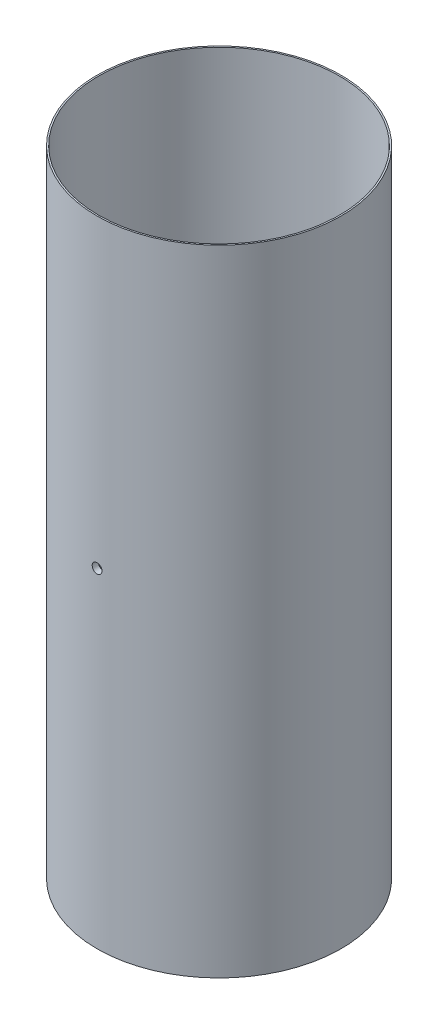
ISO-10303-21;
HEADER;
FILE_DESCRIPTION(('STEP AP214'),'2;1');
FILE_NAME('part.step','',(''),(''),'','','');
FILE_SCHEMA(('AUTOMOTIVE_DESIGN { 1 0 10303 214 1 1 1 1 }'));
ENDSEC;
DATA;
#1=APPLICATION_CONTEXT('core data for automotive mechanical design processes');
#2=APPLICATION_PROTOCOL_DEFINITION('international standard','automotive_design',2000,#1);
#3=PRODUCT_CONTEXT('',#1,'mechanical');
#4=PRODUCT('Part','Part','',(#3));
#5=PRODUCT_RELATED_PRODUCT_CATEGORY('part','',(#4));
#6=PRODUCT_DEFINITION_FORMATION('','',#4);
#7=PRODUCT_DEFINITION_CONTEXT('part definition',#1,'design');
#8=PRODUCT_DEFINITION('design','',#6,#7);
#9=PRODUCT_DEFINITION_SHAPE('','',#8);
#10=(LENGTH_UNIT() NAMED_UNIT(*) SI_UNIT(.MILLI.,.METRE.));
#11=(NAMED_UNIT(*) PLANE_ANGLE_UNIT() SI_UNIT($,.RADIAN.));
#12=(NAMED_UNIT(*) SI_UNIT($,.STERADIAN.) SOLID_ANGLE_UNIT());
#13=UNCERTAINTY_MEASURE_WITH_UNIT(LENGTH_MEASURE(1.E-05),#10,'distance_accuracy_value','');
#14=(GEOMETRIC_REPRESENTATION_CONTEXT(3) GLOBAL_UNCERTAINTY_ASSIGNED_CONTEXT((#13)) GLOBAL_UNIT_ASSIGNED_CONTEXT((#10,
#11,#12)) REPRESENTATION_CONTEXT('',''));
#15=CARTESIAN_POINT('',(0.,0.,0.));
#16=DIRECTION('',(0.,0.,1.));
#17=DIRECTION('',(1.,0.,0.));
#18=AXIS2_PLACEMENT_3D('',#15,#16,#17);
#19=CARTESIAN_POINT('',(0.,330.2,0.));
#20=DIRECTION('',(0.,-1.,0.));
#21=DIRECTION('',(0.,0.,-1.));
#22=AXIS2_PLACEMENT_3D('',#19,#20,#21);
#23=CYLINDRICAL_SURFACE('',#22,60.325);
#24=CARTESIAN_POINT('',(0.,174.0027,-60.325));
#25=CARTESIAN_POINT('',(-0.143317457979094,174.002693665914,-60.3249992751451));
#26=CARTESIAN_POINT('',(-0.286737200478642,173.990589962888,-60.324483795179));
#27=CARTESIAN_POINT('',(-0.569622111762452,173.942476494996,-60.3224769989852));
#28=CARTESIAN_POINT('',(-0.709082387997426,173.906438390723,-60.320984525984));
#29=CARTESIAN_POINT('',(-0.979909444397827,173.81148810979,-60.3171927090526));
#30=CARTESIAN_POINT('',(-1.11128023793964,173.752587383477,-60.3148937690829));
#31=CARTESIAN_POINT('',(-1.36223370345956,173.613600917658,-60.3097481113025));
#32=CARTESIAN_POINT('',(-1.48181919077537,173.53352025465,-60.3069015247986));
#33=CARTESIAN_POINT('',(-1.705935017377,173.354377973229,-60.3009784961359));
#34=CARTESIAN_POINT('',(-1.81045532214481,173.255303805161,-60.2979019028284));
#35=CARTESIAN_POINT('',(-2.00138861875198,173.041011099307,-60.2918669243713));
#36=CARTESIAN_POINT('',(-2.08780087922406,172.925791909751,-60.2889085440003));
#37=CARTESIAN_POINT('',(-2.24008967662076,172.68243121604,-60.2834426122802));
#38=CARTESIAN_POINT('',(-2.30595885682802,172.554285104293,-60.2809352225719));
#39=CARTESIAN_POINT('',(-2.41524436635302,172.288740702387,-60.2766557460153));
#40=CARTESIAN_POINT('',(-2.45866083037463,172.151342467741,-60.2748836547557));
#41=CARTESIAN_POINT('',(-2.52178326275869,171.871282047725,-60.2722758995969));
#42=CARTESIAN_POINT('',(-2.54150354843724,171.728623094666,-60.2714396702675));
#43=CARTESIAN_POINT('',(-2.55671799242051,171.442017405511,-60.2707962354679));
#44=CARTESIAN_POINT('',(-2.5522122999977,171.298070677357,-60.2709890236571));
#45=CARTESIAN_POINT('',(-2.51911465926179,171.013072769191,-60.2723813576297));
#46=CARTESIAN_POINT('',(-2.4905381747698,170.872019789726,-60.2735802570543));
#47=CARTESIAN_POINT('',(-2.41013408086554,170.596714825083,-60.2768486574536));
#48=CARTESIAN_POINT('',(-2.35830639402456,170.462462862555,-60.2789181613274));
#49=CARTESIAN_POINT('',(-2.23285338707313,170.204521009726,-60.2836952470259));
#50=CARTESIAN_POINT('',(-2.15922099951244,170.080834560747,-60.2864030356764));
#51=CARTESIAN_POINT('',(-1.99225392122157,169.847572408147,-60.2921512598635));
#52=CARTESIAN_POINT('',(-1.89891913310817,169.737996774276,-60.2951916970442));
#53=CARTESIAN_POINT('',(-1.69510933225527,169.535976672786,-60.3012653792618));
#54=CARTESIAN_POINT('',(-1.58462092257578,169.443545720025,-60.3042986167797));
#55=CARTESIAN_POINT('',(-1.34968739191737,169.278542854933,-60.3100136961694));
#56=CARTESIAN_POINT('',(-1.22524226808617,169.205970946661,-60.3126955379693));
#57=CARTESIAN_POINT('',(-0.965920108532502,169.082747604621,-60.3174056285244));
#58=CARTESIAN_POINT('',(-0.831042858191566,169.032096621969,-60.3194338638285));
#59=CARTESIAN_POINT('',(-0.55468856139866,168.954161668013,-60.3226079310419));
#60=CARTESIAN_POINT('',(-0.413211550413143,168.926877571153,-60.3237537676924));
#61=CARTESIAN_POINT('',(-0.127791119203112,168.896467498313,-60.3250332802157));
#62=CARTESIAN_POINT('',(0.0161503055997033,168.893322825337,-60.3251677394411));
#63=CARTESIAN_POINT('',(0.302516740314691,168.91123210344,-60.3244114198497));
#64=CARTESIAN_POINT('',(0.444941753794973,168.932285997568,-60.3235206434458));
#65=CARTESIAN_POINT('',(0.724180174019501,168.997979293169,-60.3208147142999));
#66=CARTESIAN_POINT('',(0.860995587746223,169.042610178587,-60.3189998953324));
#67=CARTESIAN_POINT('',(1.1251928643938,169.154181916951,-60.3146502833695));
#68=CARTESIAN_POINT('',(1.25257468860698,169.221122861433,-60.31211548742));
#69=CARTESIAN_POINT('',(1.4943748341866,169.375462507485,-60.3066092958923));
#70=CARTESIAN_POINT('',(1.60878513497744,169.462873765013,-60.3036376327692));
#71=CARTESIAN_POINT('',(1.82131394325068,169.655654368962,-60.2975933739145));
#72=CARTESIAN_POINT('',(1.91943237418402,169.761023799758,-60.2945207777086));
#73=CARTESIAN_POINT('',(2.09665495349342,169.986810001499,-60.2886187676289));
#74=CARTESIAN_POINT('',(2.17574702044189,170.107236259923,-60.2857895089989));
#75=CARTESIAN_POINT('',(2.31258917849996,170.359669552573,-60.2806956275811));
#76=CARTESIAN_POINT('',(2.37033934272182,170.491676547125,-60.2784310028588));
#77=CARTESIAN_POINT('',(2.46283725385677,170.76347903814,-60.274722850436));
#78=CARTESIAN_POINT('',(2.49759275293561,170.903271892516,-60.2732790460364));
#79=CARTESIAN_POINT('',(2.54314012865479,171.186715035704,-60.2713745560592));
#80=CARTESIAN_POINT('',(2.55393209026697,171.330365310836,-60.2709138669957));
#81=CARTESIAN_POINT('',(2.55124516330251,171.617325170998,-60.271027652173));
#82=CARTESIAN_POINT('',(2.53778529304992,171.760634934818,-60.2716013152736));
#83=CARTESIAN_POINT('',(2.48701602108585,172.042958399298,-60.2737174315815));
#84=CARTESIAN_POINT('',(2.44970657301593,172.181972091606,-60.275259886672));
#85=CARTESIAN_POINT('',(2.35230077757007,172.451762191647,-60.2791395577469));
#86=CARTESIAN_POINT('',(2.29220414697198,172.582538496973,-60.2814767836096));
#87=CARTESIAN_POINT('',(2.15093392569781,172.832145027295,-60.2866824629476));
#88=CARTESIAN_POINT('',(2.06976103281406,172.950975647609,-60.2895508988348));
#89=CARTESIAN_POINT('',(1.88857702492375,173.173410959401,-60.2954981735654));
#90=CARTESIAN_POINT('',(1.78855320635184,173.277005298901,-60.2985771533968));
#91=CARTESIAN_POINT('',(1.57250461106337,173.465962240335,-60.3045977232874));
#92=CARTESIAN_POINT('',(1.45647589280637,173.551320337974,-60.3075392792636));
#93=CARTESIAN_POINT('',(1.21164043765563,173.701410349287,-60.3129550624573));
#94=CARTESIAN_POINT('',(1.08282330374682,173.766125296948,-60.3154289045977));
#95=CARTESIAN_POINT('',(0.816239502913559,173.872932594486,-60.3196242956862));
#96=CARTESIAN_POINT('',(0.678483670473789,173.915051778764,-60.3213467365311));
#97=CARTESIAN_POINT('',(0.449887952200836,173.964373344458,-60.3233875427674));
#98=CARTESIAN_POINT('',(0.360530143175026,173.978727608783,-60.3239895718358));
#99=CARTESIAN_POINT('',(0.180795126305207,173.997892931756,-60.3247960289856));
#100=CARTESIAN_POINT('',(0.0904179190728285,174.002703996128,-60.3250004573056));
#101=CARTESIAN_POINT('',(0.,174.0027,-60.325));
#102=B_SPLINE_CURVE_WITH_KNOTS('',3,(#24,#25,#26,#27,#28,#29,#30,#31,#32,#33,#34,#35,#36,#37,
#38,#39,#40,#41,#42,#43,#44,#45,#46,#47,#48,#49,#50,#51,#52,#53,#54,#55,#56,#57,#58,#59,#60,#61,
#62,#63,#64,#65,#66,#67,#68,#69,#70,#71,#72,#73,#74,#75,#76,#77,#78,#79,#80,#81,#82,#83,#84,#85,
#86,#87,#88,#89,#90,#91,#92,#93,#94,#95,#96,#97,#98,#99,#100,#101),.UNSPECIFIED.,.T.,.F.,(4,2,2,
2,2,2,2,2,2,2,2,2,2,2,2,2,2,2,2,2,2,2,2,2,2,2,2,2,2,2,2,2,2,2,2,2,2,2,4),(0.,0.42962232463234,
0.859754250487278,1.28967102961894,1.71948485768683,2.14958366330685,2.57969983687575,
3.00996986368173,3.44023730907534,3.87024465440208,4.30024935016874,4.72997800812708,
5.15970809713291,5.58957762517492,6.01944927798641,6.44965836433409,6.87986753860206,
7.31008556584942,7.74030128141452,8.17018374320933,8.60006519326841,9.02979147536634,
9.45951952060887,9.88951184343607,10.3195061865701,10.7497728525404,11.1800380445064,
11.6101581076354,12.0402766456074,12.4700580307486,12.8998402512945,13.3296278137838,
13.759401148692,14.1894651485486,14.6196352503595,15.0501579910972,15.4801683110534,
15.7512140052349,16.0222595367999),.UNSPECIFIED.);
#103=CARTESIAN_POINT('',(0.,174.0027,-60.325));
#104=VERTEX_POINT('',#103);
#105=EDGE_CURVE('E135',#104,#104,#102,.T.);
#106=ORIENTED_EDGE('',*,*,#105,.F.);
#107=EDGE_LOOP('',(#106));
#108=FACE_BOUND('',#107,.T.);
#109=CARTESIAN_POINT('',(2.55269999999999,171.45,60.2709660426146));
#110=CARTESIAN_POINT('',(2.55269366585535,171.306682606805,60.270966769915));
#111=CARTESIAN_POINT('',(2.54058997340111,171.163262928867,60.2714827238882));
#112=CARTESIAN_POINT('',(2.49247655132331,170.880378151732,60.27349121323));
#113=CARTESIAN_POINT('',(2.4564384820735,170.740917945135,60.2749849062656));
#114=CARTESIAN_POINT('',(2.36148830361135,170.470091035932,60.2787793713388));
#115=CARTESIAN_POINT('',(2.30258764641778,170.338720319361,60.2810797392522));
#116=CARTESIAN_POINT('',(2.16360134332727,170.087766982597,60.2862278359019));
#117=CARTESIAN_POINT('',(2.08352077375679,169.968181547165,60.2890754334355));
#118=CARTESIAN_POINT('',(1.9043785863625,169.744065661118,60.2949996290089));
#119=CARTESIAN_POINT('',(1.8053043980447,169.63954526166,60.2980763778779));
#120=CARTESIAN_POINT('',(1.59101161204826,169.448611782545,60.3041107398421));
#121=CARTESIAN_POINT('',(1.47579236285749,169.362199433965,60.3070683481233));
#122=CARTESIAN_POINT('',(1.23243161774974,169.209910545102,60.3125321439056));
#123=CARTESIAN_POINT('',(1.10428552448965,169.144041345169,60.3150381699156));
#124=CARTESIAN_POINT('',(0.838741162783114,169.034755794061,60.3193149277687));
#125=CARTESIAN_POINT('',(0.701342949751084,168.991339308423,60.3210856640152));
#126=CARTESIAN_POINT('',(0.421282592446688,168.928216829876,60.3236913133244));
#127=CARTESIAN_POINT('',(0.278623680828125,168.908496518101,60.3245267915137));
#128=CARTESIAN_POINT('',(-0.00798192744215867,168.893282007569,60.3251696566807));
#129=CARTESIAN_POINT('',(-0.151928616168194,168.897787659815,60.3249770499815));
#130=CARTESIAN_POINT('',(-0.436926703465465,168.930885237666,60.3235859311543));
#131=CARTESIAN_POINT('',(-0.577979896774923,168.959461739873,60.3223880631493));
#132=CARTESIAN_POINT('',(-0.853285279983554,169.039865943618,60.3191221230065));
#133=CARTESIAN_POINT('',(-0.987537447348437,169.091693722189,60.3170540479855));
#134=CARTESIAN_POINT('',(-1.2454795456604,169.217146917569,60.3122795948867));
#135=CARTESIAN_POINT('',(-1.36916604582705,169.290779380178,60.3095730105435));
#136=CARTESIAN_POINT('',(-1.60242826883088,169.457746617844,60.3038264409255));
#137=CARTESIAN_POINT('',(-1.71200392188386,169.551081490331,60.3007864540021));
#138=CARTESIAN_POINT('',(-1.91402392536733,169.754891350147,60.294712724434));
#139=CARTESIAN_POINT('',(-2.006454778053,169.865379717418,60.2916789885532));
#140=CARTESIAN_POINT('',(-2.17145746156611,170.100313127896,60.2859621782017));
#141=CARTESIAN_POINT('',(-2.24402928813479,170.224758174094,60.2832791038062));
#142=CARTESIAN_POINT('',(-2.36725257171868,170.484080314517,60.2785663515859));
#143=CARTESIAN_POINT('',(-2.4179035520588,170.618957635519,60.2765366879699));
#144=CARTESIAN_POINT('',(-2.49583847965579,170.895312085615,60.2733601982388));
#145=CARTESIAN_POINT('',(-2.52312255288602,171.036789179125,60.2722133673642));
#146=CARTESIAN_POINT('',(-2.55353253690702,171.322209645685,60.2709327384656));
#147=CARTESIAN_POINT('',(-2.55667716719104,171.466151020912,60.270798155472));
#148=CARTESIAN_POINT('',(-2.53876782140728,171.752517346154,60.2715551499145));
#149=CARTESIAN_POINT('',(-2.51771390228666,171.894942299736,60.2724467249357));
#150=CARTESIAN_POINT('',(-2.4520206165943,172.174180437366,60.2751548224208));
#151=CARTESIAN_POINT('',(-2.40738979121927,172.310995634327,60.2769710099172));
#152=CARTESIAN_POINT('',(-2.29581824572706,172.575192504094,60.2813233301554));
#153=CARTESIAN_POINT('',(-2.22887743372344,172.702574138042,60.2838594658624));
#154=CARTESIAN_POINT('',(-2.07453797998615,172.94437415868,60.2893677272064));
#155=CARTESIAN_POINT('',(-1.98712674858355,173.058784503273,60.2923401207281));
#156=CARTESIAN_POINT('',(-1.79434617221696,173.27131341213,60.2983849063888));
#157=CARTESIAN_POINT('',(-1.68897674308451,173.369431900033,60.3014572989965));
#158=CARTESIAN_POINT('',(-1.46319051552521,173.546654595771,60.3073580568805));
#159=CARTESIAN_POINT('',(-1.34276422951219,173.625746722063,60.3101862663762));
#160=CARTESIAN_POINT('',(-1.09033086648997,173.762588984389,60.3152776633471));
#161=CARTESIAN_POINT('',(-0.958323829156338,173.820339193535,60.3175408527578));
#162=CARTESIAN_POINT('',(-0.686521370575466,173.912837135892,60.3212463770604));
#163=CARTESIAN_POINT('',(-0.546728598031786,173.947592640689,60.322688989262));
#164=CARTESIAN_POINT('',(-0.26328562688929,173.993140055599,60.3245918626342));
#165=CARTESIAN_POINT('',(-0.119635441900555,174.003932050249,60.3250521272704));
#166=CARTESIAN_POINT('',(0.167324480361365,174.001245216798,60.3249384478098));
#167=CARTESIAN_POINT('',(0.310634396047115,173.987785367746,60.3243653124329));
#168=CARTESIAN_POINT('',(0.592958169379343,173.937016084621,60.3222509703151));
#169=CARTESIAN_POINT('',(0.73197201872382,173.899706604463,60.3207097617036));
#170=CARTESIAN_POINT('',(1.00176242336622,173.802300688776,60.316832756721));
#171=CARTESIAN_POINT('',(1.1325388762738,173.742203970069,60.3144969504754));
#172=CARTESIAN_POINT('',(1.38214566478745,173.600933527126,60.3092936617772));
#173=CARTESIAN_POINT('',(1.50097639580075,173.519760500842,60.3064261969316));
#174=CARTESIAN_POINT('',(1.7234116935399,173.338576349411,60.3004799962356));
#175=CARTESIAN_POINT('',(1.8270059329349,173.238552550974,60.2974011191442));
#176=CARTESIAN_POINT('',(2.01596268183733,173.022504036694,60.2913798359727));
#177=CARTESIAN_POINT('',(2.10132068679335,172.906475379094,60.2884374637512));
#178=CARTESIAN_POINT('',(2.25141060196452,172.661639970102,60.2830194834172));
#179=CARTESIAN_POINT('',(2.31612552854995,172.532822810909,60.2805442603213));
#180=CARTESIAN_POINT('',(2.42293277960863,172.266238955828,60.2763461543542));
#181=CARTESIAN_POINT('',(2.4650519388165,172.128483094566,60.2746223795213));
#182=CARTESIAN_POINT('',(2.51437343155852,171.89988744372,60.2725799087108));
#183=CARTESIAN_POINT('',(2.52872766312235,171.810529736095,60.2719773603131));
#184=CARTESIAN_POINT('',(2.54789294255275,171.630794922529,60.2711701979607));
#185=CARTESIAN_POINT('',(2.55270399616207,171.540417817202,60.2709655837665));
#186=CARTESIAN_POINT('',(2.55269999999999,171.45,60.2709660426146));
#187=B_SPLINE_CURVE_WITH_KNOTS('',3,(#109,#110,#111,#112,#113,#114,#115,#116,#117,#118,#119,
#120,#121,#122,#123,#124,#125,#126,#127,#128,#129,#130,#131,#132,#133,#134,#135,#136,#137,#138,
#139,#140,#141,#142,#143,#144,#145,#146,#147,#148,#149,#150,#151,#152,#153,#154,#155,#156,#157,
#158,#159,#160,#161,#162,#163,#164,#165,#166,#167,#168,#169,#170,#171,#172,#173,#174,#175,#176,
#177,#178,#179,#180,#181,#182,#183,#184,#185,#186),.UNSPECIFIED.,.T.,.F.,(4,2,2,2,2,2,2,2,2,2,2,
2,2,2,2,2,2,2,2,2,2,2,2,2,2,2,2,2,2,2,2,2,2,2,2,2,2,2,4),(0.,0.429622130074634,
0.859753865607661,1.28967042282568,1.71948403239451,2.14958309251469,2.57969951370257,
3.00996944577267,3.4402368010235,3.87024402802001,4.30024861033492,4.72997787661082,
5.15970856664404,5.58957826838809,6.01945009594058,6.44965892939677,6.87986785511062,
7.31008613537079,7.74030209626622,8.17018440243942,8.60006569696022,9.02979136524064,
9.45951880342153,9.88951122887147,10.3195056697128,10.7497724360557,11.1800377283655,
11.6101575282617,12.0402758107685,12.4700576367726,12.8998402932635,13.329628290873,
13.7594020576743,14.1894657968488,14.6196356440103,15.0501584963708,15.4801689215163,
15.7512143105836,16.0222595365451),.UNSPECIFIED.);
#188=CARTESIAN_POINT('',(2.55269999999999,171.45,60.2709660426146));
#189=VERTEX_POINT('',#188);
#190=EDGE_CURVE('E74',#189,#189,#187,.T.);
#191=ORIENTED_EDGE('',*,*,#190,.F.);
#192=EDGE_LOOP('',(#191));
#193=FACE_BOUND('',#192,.T.);
#194=CARTESIAN_POINT('',(0.,158.75,0.));
#195=DIRECTION('',(0.,1.,0.));
#196=DIRECTION('',(0.,0.,1.));
#197=AXIS2_PLACEMENT_3D('',#194,#195,#196);
#198=CIRCLE('',#197,60.325);
#199=CARTESIAN_POINT('',(0.,158.75,60.325));
#200=VERTEX_POINT('',#199);
#201=EDGE_CURVE('E53',#200,#200,#198,.T.);
#202=ORIENTED_EDGE('',*,*,#201,.F.);
#203=EDGE_LOOP('',(#202));
#204=FACE_BOUND('',#203,.T.);
#205=CARTESIAN_POINT('',(0.,209.55,0.));
#206=DIRECTION('',(0.,1.,0.));
#207=DIRECTION('',(0.,0.,1.));
#208=AXIS2_PLACEMENT_3D('',#205,#206,#207);
#209=CIRCLE('',#208,60.325);
#210=CARTESIAN_POINT('',(0.,209.55,60.325));
#211=VERTEX_POINT('',#210);
#212=EDGE_CURVE('E62',#211,#211,#209,.T.);
#213=ORIENTED_EDGE('',*,*,#212,.T.);
#214=EDGE_LOOP('',(#213));
#215=FACE_BOUND('',#214,.T.);
#216=ADVANCED_FACE('F36',(#108,#193,#204,#215),#23,.F.);
#217=CARTESIAN_POINT('',(0.,0.,0.));
#218=DIRECTION('',(0.,1.,0.));
#219=DIRECTION('',(0.,0.,1.));
#220=AXIS2_PLACEMENT_3D('',#217,#218,#219);
#221=PLANE('',#220);
#222=CARTESIAN_POINT('',(0.,0.,0.));
#223=DIRECTION('',(0.,1.,0.));
#224=DIRECTION('',(0.,0.,1.));
#225=AXIS2_PLACEMENT_3D('',#222,#223,#224);
#226=CIRCLE('',#225,63.5);
#227=CARTESIAN_POINT('',(0.,0.,63.5));
#228=VERTEX_POINT('',#227);
#229=EDGE_CURVE('E41',#228,#228,#226,.T.);
#230=ORIENTED_EDGE('',*,*,#229,.F.);
#231=EDGE_LOOP('',(#230));
#232=FACE_BOUND('',#231,.T.);
#233=CARTESIAN_POINT('',(0.,0.,0.));
#234=DIRECTION('',(0.,1.,0.));
#235=DIRECTION('',(0.,0.,1.));
#236=AXIS2_PLACEMENT_3D('',#233,#234,#235);
#237=CIRCLE('',#236,62.70625);
#238=CARTESIAN_POINT('',(0.,0.,62.70625));
#239=VERTEX_POINT('',#238);
#240=EDGE_CURVE('E50',#239,#239,#237,.T.);
#241=ORIENTED_EDGE('',*,*,#240,.T.);
#242=EDGE_LOOP('',(#241));
#243=FACE_BOUND('',#242,.T.);
#244=ADVANCED_FACE('F109',(#232,#243),#221,.F.);
#245=CARTESIAN_POINT('',(0.,330.2,0.));
#246=DIRECTION('',(0.,1.,0.));
#247=DIRECTION('',(0.,0.,1.));
#248=AXIS2_PLACEMENT_3D('',#245,#246,#247);
#249=PLANE('',#248);
#250=CARTESIAN_POINT('',(0.,330.2,0.));
#251=DIRECTION('',(0.,1.,0.));
#252=DIRECTION('',(0.,0.,1.));
#253=AXIS2_PLACEMENT_3D('',#250,#251,#252);
#254=CIRCLE('',#253,62.70625);
#255=CARTESIAN_POINT('',(0.,330.2,62.70625));
#256=VERTEX_POINT('',#255);
#257=EDGE_CURVE('E59',#256,#256,#254,.T.);
#258=ORIENTED_EDGE('',*,*,#257,.F.);
#259=EDGE_LOOP('',(#258));
#260=FACE_BOUND('',#259,.T.);
#261=CARTESIAN_POINT('',(0.,330.2,0.));
#262=DIRECTION('',(0.,1.,0.));
#263=DIRECTION('',(0.,0.,1.));
#264=AXIS2_PLACEMENT_3D('',#261,#262,#263);
#265=CIRCLE('',#264,63.5);
#266=CARTESIAN_POINT('',(0.,330.2,63.5));
#267=VERTEX_POINT('',#266);
#268=EDGE_CURVE('E10',#267,#267,#265,.T.);
#269=ORIENTED_EDGE('',*,*,#268,.T.);
#270=EDGE_LOOP('',(#269));
#271=FACE_BOUND('',#270,.T.);
#272=ADVANCED_FACE('F111',(#260,#271),#249,.T.);
#273=CARTESIAN_POINT('',(0.,330.2,0.));
#274=DIRECTION('',(0.,-1.,0.));
#275=DIRECTION('',(0.,0.,-1.));
#276=AXIS2_PLACEMENT_3D('',#273,#274,#275);
#277=CYLINDRICAL_SURFACE('',#276,63.5);
#278=CARTESIAN_POINT('',(0.,174.0027,-63.5));
#279=CARTESIAN_POINT('',(-0.143324163865528,174.002693663444,-63.4999993108626));
#280=CARTESIAN_POINT('',(-0.286750776503003,173.990588832225,-63.4995095585936));
#281=CARTESIAN_POINT('',(-0.569649698596532,173.942470621785,-63.4976029218357));
#282=CARTESIAN_POINT('',(-0.709117108177663,173.906428857747,-63.4961849366614));
#283=CARTESIAN_POINT('',(-0.979958466547345,173.811468284893,-63.4925823764552));
#284=CARTESIAN_POINT('',(-1.11133641098022,173.752560876888,-63.4903981835068));
#285=CARTESIAN_POINT('',(-1.36230276367632,173.613558063883,-63.4855094101114));
#286=CARTESIAN_POINT('',(-1.48189399790386,173.533467754709,-63.4828049548631));
#287=CARTESIAN_POINT('',(-1.70601264493531,173.354308618505,-63.4771779187533));
#288=CARTESIAN_POINT('',(-1.81053084461074,173.255228269583,-63.4742552061283));
#289=CARTESIAN_POINT('',(-2.00145838710848,173.040923561139,-63.4685222100152));
#290=CARTESIAN_POINT('',(-2.08786700052276,172.925698551662,-63.4657119310593));
#291=CARTESIAN_POINT('',(-2.24014403601524,172.682332029694,-63.4605198749886));
#292=CARTESIAN_POINT('',(-2.30600585832989,172.554186384463,-63.4581382356594));
#293=CARTESIAN_POINT('',(-2.41527721344684,172.288645393164,-63.45407349426));
#294=CARTESIAN_POINT('',(-2.45868687218565,172.151250098983,-63.4523903882716));
#295=CARTESIAN_POINT('',(-2.52179893348719,171.871189345103,-63.4499136141698));
#296=CARTESIAN_POINT('',(-2.54151425445321,171.728526800939,-63.4491194614059));
#297=CARTESIAN_POINT('',(-2.55671782931915,171.441915022742,-63.4485086868518));
#298=CARTESIAN_POINT('',(-2.55220622218856,171.297965796096,-63.4486920594545));
#299=CARTESIAN_POINT('',(-2.5190948250792,171.012954536371,-63.4500152062028));
#300=CARTESIAN_POINT('',(-2.49050898803539,170.871890879372,-63.4511544263571));
#301=CARTESIAN_POINT('',(-2.41008218368811,170.596566132232,-63.4542599821565));
#302=CARTESIAN_POINT('',(-2.35824114407913,170.462305063243,-63.4562263203732));
#303=CARTESIAN_POINT('',(-2.23275952639916,170.204351701722,-63.4607651064348));
#304=CARTESIAN_POINT('',(-2.15911256763877,170.080662516328,-63.4633377316418));
#305=CARTESIAN_POINT('',(-1.99211436136792,169.847398025356,-63.4687989202082));
#306=CARTESIAN_POINT('',(-1.89876302672559,169.737822782192,-63.4716874849645));
#307=CARTESIAN_POINT('',(-1.69492713162012,169.535815374865,-63.4774574157225));
#308=CARTESIAN_POINT('',(-1.58443048156107,169.443395409099,-63.4803387751754));
#309=CARTESIAN_POINT('',(-1.34948311913359,169.278415970977,-63.4857675327437));
#310=CARTESIAN_POINT('',(-1.22503240404121,169.205856502498,-63.4883149307938));
#311=CARTESIAN_POINT('',(-0.965702663795686,169.082659026906,-63.4927887022344));
#312=CARTESIAN_POINT('',(-0.83082344717747,169.032021422386,-63.4947150642194));
#313=CARTESIAN_POINT('',(-0.554468529310304,168.954112960823,-63.4977294596276));
#314=CARTESIAN_POINT('',(-0.412992860080086,168.926841990372,-63.4988174971195));
#315=CARTESIAN_POINT('',(-0.127566965425893,168.896455906389,-63.5000320846466));
#316=CARTESIAN_POINT('',(0.0163814606246293,168.893323916424,-63.5001593064215));
#317=CARTESIAN_POINT('',(0.302759796805921,168.9112606915,-63.4994397041971));
#318=CARTESIAN_POINT('',(0.445189710153911,168.932329405258,-63.4985928822618));
#319=CARTESIAN_POINT('',(0.724440803678022,168.998055557016,-63.4960210368165));
#320=CARTESIAN_POINT('',(0.861263794821022,169.042705312879,-63.4942962993169));
#321=CARTESIAN_POINT('',(1.12547283299773,169.154318317662,-63.4901628977695));
#322=CARTESIAN_POINT('',(1.25285884516994,169.221281649006,-63.4877542311955));
#323=CARTESIAN_POINT('',(1.49465550486585,169.375664311978,-63.4825224674313));
#324=CARTESIAN_POINT('',(1.60905890805599,169.463094981914,-63.4796991408558));
#325=CARTESIAN_POINT('',(1.82157006426561,169.655913876299,-63.4739569107453));
#326=CARTESIAN_POINT('',(1.91967774758246,169.761302177555,-63.4710380068016));
#327=CARTESIAN_POINT('',(2.09686912086968,169.987117199954,-63.4654317380428));
#328=CARTESIAN_POINT('',(2.1759419091002,170.107552479173,-63.4627445064749));
#329=CARTESIAN_POINT('',(2.3127444063352,170.359999305218,-63.4579066704929));
#330=CARTESIAN_POINT('',(2.37047418356619,170.492010815037,-63.4557560643634));
#331=CARTESIAN_POINT('',(2.4629328476805,170.763822030366,-63.4522349230489));
#332=CARTESIAN_POINT('',(2.49766874109287,170.903619349351,-63.4508641502566));
#333=CARTESIAN_POINT('',(2.54317655354907,171.18706743842,-63.4490565697664));
#334=CARTESIAN_POINT('',(2.55394854502168,171.330718196856,-63.4486197592457));
#335=CARTESIAN_POINT('',(2.55122198426378,171.617686730906,-63.4487294402859));
#336=CARTESIAN_POINT('',(2.53774059726566,171.761004670195,-63.449275236411));
#337=CARTESIAN_POINT('',(2.48692536734883,172.043341007101,-63.4512871420568));
#338=CARTESIAN_POINT('',(2.44959147786673,172.182359396324,-63.4527532533739));
#339=CARTESIAN_POINT('',(2.35213412028957,172.452155071768,-63.4564403902687));
#340=CARTESIAN_POINT('',(2.29201034561928,172.5829322471,-63.4586614260018));
#341=CARTESIAN_POINT('',(2.15068378776467,172.832535502093,-63.4636079709533));
#342=CARTESIAN_POINT('',(2.06948171504609,172.951361984378,-63.4663334631676));
#343=CARTESIAN_POINT('',(1.8882454314426,173.173774447248,-63.4719838244392));
#344=CARTESIAN_POINT('',(1.78819994642528,173.277351237404,-63.4749088121842));
#345=CARTESIAN_POINT('',(1.57211121270376,173.466269200863,-63.4806279276599));
#346=CARTESIAN_POINT('',(1.45606402046022,173.551605865719,-63.4834220229047));
#347=CARTESIAN_POINT('',(1.2112003105724,173.701646961239,-63.488565836553));
#348=CARTESIAN_POINT('',(1.08237382857637,173.766335123308,-63.490915203973));
#349=CARTESIAN_POINT('',(0.81577735670584,173.8730879766,-63.4948990520177));
#350=CARTESIAN_POINT('',(0.678018205643144,173.915179531199,-63.4965343810742));
#351=CARTESIAN_POINT('',(0.449495981723146,173.964440597619,-63.4984708402344));
#352=CARTESIAN_POINT('',(0.360214849140348,173.978769702843,-63.4990417727471));
#353=CARTESIAN_POINT('',(0.180636044570101,173.997901398457,-63.4998065697127));
#354=CARTESIAN_POINT('',(0.0903383731305897,174.002703993982,-63.5000004343688));
#355=CARTESIAN_POINT('',(0.,174.0027,-63.5));
#356=B_SPLINE_CURVE_WITH_KNOTS('',3,(#278,#279,#280,#281,#282,#283,#284,#285,#286,#287,#288,
#289,#290,#291,#292,#293,#294,#295,#296,#297,#298,#299,#300,#301,#302,#303,#304,#305,#306,#307,
#308,#309,#310,#311,#312,#313,#314,#315,#316,#317,#318,#319,#320,#321,#322,#323,#324,#325,#326,
#327,#328,#329,#330,#331,#332,#333,#334,#335,#336,#337,#338,#339,#340,#341,#342,#343,#344,#345,
#346,#347,#348,#349,#350,#351,#352,#353,#354,#355),.UNSPECIFIED.,.T.,.F.,(4,2,2,2,2,2,2,2,2,2,2,
2,2,2,2,2,2,2,2,2,2,2,2,2,2,2,2,2,2,2,2,2,2,2,2,2,2,2,4),(0.,0.429642735051301,
0.859795859509039,1.28973478451083,1.71957037593729,2.1496675933084,2.57978213057264,
3.01003468152736,3.4402848191247,3.87030027323007,4.30031326070125,4.73007719275393,
5.15984246104587,5.58973360861272,6.01962665717901,6.44982422340235,6.88002187360387,
7.3102274240195,7.74043088646398,8.17033355080105,8.60023530413728,9.02999709213105,
9.45976046764507,9.88976248529206,10.3197663421639,10.750015889714,11.1802640618872,
11.6103810715439,12.0404967812079,12.4703081979327,12.9001204537118,13.329938491638,
13.7597420439855,14.1898035721174,14.6199712767833,15.0504770712375,15.4804699305665,
15.7512773477203,16.0220846189096),.UNSPECIFIED.);
#357=CARTESIAN_POINT('',(0.,174.0027,-63.5));
#358=VERTEX_POINT('',#357);
#359=EDGE_CURVE('E130',#358,#358,#356,.T.);
#360=ORIENTED_EDGE('',*,*,#359,.T.);
#361=EDGE_LOOP('',(#360));
#362=FACE_BOUND('',#361,.T.);
#363=CARTESIAN_POINT('',(2.55269999999999,171.45,63.4486699837751));
#364=CARTESIAN_POINT('',(2.552693663396,171.306675888904,63.4486706750145));
#365=CARTESIAN_POINT('',(2.54058884078871,171.163249328855,63.4491608337411));
#366=CARTESIAN_POINT('',(2.49247066766812,170.880350516032,63.4510689222643));
#367=CARTESIAN_POINT('',(2.45642893215974,170.740883163174,63.4524879535126));
#368=CARTESIAN_POINT('',(2.36146844277739,170.470041924702,63.4560927843434));
#369=CARTESIAN_POINT('',(2.30256109107704,170.338664042964,63.4582782017073));
#370=CARTESIAN_POINT('',(2.16355841062886,170.08769779514,63.4631690663193));
#371=CARTESIAN_POINT('',(2.08346817756834,169.96810660317,63.4658743884579));
#372=CARTESIAN_POINT('',(1.90430911795094,169.743987907707,63.471502424737));
#373=CARTESIAN_POINT('',(1.80522875252831,169.639469630898,63.474425270386));
#374=CARTESIAN_POINT('',(1.5909239787919,169.448541939737,63.4801577372533));
#375=CARTESIAN_POINT('',(1.47569892073334,169.362133254556,63.4829673539087));
#376=CARTESIAN_POINT('',(1.23233235691089,169.209856144574,63.488157578441));
#377=CARTESIAN_POINT('',(1.10418672675467,169.1439943062,63.490538048649));
#378=CARTESIAN_POINT('',(0.838645768237071,169.034722917223,63.4946004593694));
#379=CARTESIAN_POINT('',(0.701250491682372,168.991313240879,63.4962824037937));
#380=CARTESIAN_POINT('',(0.421189788883833,168.928201141964,63.498757372703));
#381=CARTESIAN_POINT('',(0.278527278453449,168.908485799732,63.4995508816034));
#382=CARTESIAN_POINT('',(-0.00808443390580254,168.893282170649,63.500161167944));
#383=CARTESIAN_POINT('',(-0.152033628461218,168.897793745052,63.4999779509777));
#384=CARTESIAN_POINT('',(-0.437045034136754,168.93090509095,63.4986558461189));
#385=CARTESIAN_POINT('',(-0.578108865336525,168.959490942437,63.4975175104876));
#386=CARTESIAN_POINT('',(-0.853433953441149,169.039917836291,63.4944140645559));
#387=CARTESIAN_POINT('',(-0.987695189287877,169.091758950641,63.4924489516962));
#388=CARTESIAN_POINT('',(-1.24564875072634,169.217240721826,63.4879124230396));
#389=CARTESIAN_POINT('',(-1.3693379777714,169.290887741705,63.4853408303142));
#390=CARTESIAN_POINT('',(-1.60260252600699,169.457886077754,63.4798810599835));
#391=CARTESIAN_POINT('',(-1.71217778475484,169.551237481095,63.4769928809775));
#392=CARTESIAN_POINT('',(-1.91418511223584,169.755073424193,63.4712229086885));
#393=CARTESIAN_POINT('',(-2.00660499650498,169.865570039712,63.4683411213695));
#394=CARTESIAN_POINT('',(-2.17158428676358,170.100517304264,63.4629108788131));
#395=CARTESIAN_POINT('',(-2.24414368871319,170.224967956136,63.4603624236434));
#396=CARTESIAN_POINT('',(-2.36734111671044,170.484297680836,63.455886370158));
#397=CARTESIAN_POINT('',(-2.41797871934749,170.61917695503,63.4539587838343));
#398=CARTESIAN_POINT('',(-2.49588715943317,170.895531997804,63.4509423120456));
#399=CARTESIAN_POINT('',(-2.52315811062922,171.037007734271,63.4498534224979));
#400=CARTESIAN_POINT('',(-2.55354412224376,171.322433657673,63.448637878351));
#401=CARTESIAN_POINT('',(-2.55667607743351,171.466382043279,63.4485105507603));
#402=CARTESIAN_POINT('',(-2.53873924724854,171.752760290164,63.4492307321378));
#403=CARTESIAN_POINT('',(-2.51767051315334,171.895190154658,63.4500782390405));
#404=CARTESIAN_POINT('',(-2.4519443695262,172.17444101795,63.4526519440623));
#405=CARTESIAN_POINT('',(-2.40729466259949,172.311263832544,63.4543778552484));
#406=CARTESIAN_POINT('',(-2.2956818149746,172.575472539345,63.4585135793012));
#407=CARTESIAN_POINT('',(-2.22871859156636,172.702858396568,63.4609233947029));
#408=CARTESIAN_POINT('',(-2.0743360852345,172.944654954598,63.4661569326452));
#409=CARTESIAN_POINT('',(-1.98690543653466,173.05905839353,63.4689808848336));
#410=CARTESIAN_POINT('',(-1.79408656450889,173.27156963178,63.4747235652279));
#411=CARTESIAN_POINT('',(-1.68869826454295,173.369677361547,63.4776422938384));
#412=CARTESIAN_POINT('',(-1.46288322107772,173.546868829651,63.4832474876839));
#413=CARTESIAN_POINT('',(-1.34244791942971,173.625941666172,63.4859338192572));
#414=CARTESIAN_POINT('',(-1.09000103617453,173.762744248256,63.4907695246457));
#415=CARTESIAN_POINT('',(-0.957989491574891,173.820474062046,63.4929189001774));
#416=CARTESIAN_POINT('',(-0.686178302718884,173.912932751597,63.4964377887801));
#417=CARTESIAN_POINT('',(-0.546381050367934,173.947668649691,63.4978075399302));
#418=CARTESIAN_POINT('',(-0.262933101381878,173.993176494109,63.4996137354826));
#419=CARTESIAN_POINT('',(-0.119282416338101,174.00394851251,63.500050182692));
#420=CARTESIAN_POINT('',(0.16768616842007,174.001222027919,63.4999405932366));
#421=CARTESIAN_POINT('',(0.311004231499586,173.98774065816,63.4993952501341));
#422=CARTESIAN_POINT('',(0.593340820146125,173.93692541906,63.4973848666408));
#423=CARTESIAN_POINT('',(0.732359337359407,173.899591503378,63.4959198244631));
#424=CARTESIAN_POINT('',(1.00215526088944,173.802134047762,63.4922349739625));
#425=CARTESIAN_POINT('',(1.132932556338,173.742010201315,63.4900151554883));
#426=CARTESIAN_POINT('',(1.38253602144205,173.60068346292,63.4850706599731));
#427=CARTESIAN_POINT('',(1.5013625937943,173.519481281567,63.4823459999523));
#428=CARTESIAN_POINT('',(1.72377504508918,173.338244881128,63.4766965580457));
#429=CARTESIAN_POINT('',(1.82735175367815,173.23819941256,63.4737716572832));
#430=CARTESIAN_POINT('',(2.01626956028279,173.022110744924,63.4680519282087));
#431=CARTESIAN_POINT('',(2.10160614964166,172.90606360214,63.4652571321897));
#432=CARTESIAN_POINT('',(2.25164716690948,172.661199929832,63.460111433733));
#433=CARTESIAN_POINT('',(2.31633531185624,172.532373427165,63.4577608822107));
#434=CARTESIAN_POINT('',(2.42308812735004,172.265776910937,63.4537747068288));
#435=CARTESIAN_POINT('',(2.46517966154497,172.128017736302,63.4521382344821));
#436=CARTESIAN_POINT('',(2.51444066855112,171.899495567264,63.4502003495443));
#437=CARTESIAN_POINT('',(2.52876974709496,171.810214517331,63.4496289724738));
#438=CARTESIAN_POINT('',(2.54790140725018,171.630635878472,63.4488635718444));
#439=CARTESIAN_POINT('',(2.55270399401024,171.540338290095,63.4486695480815));
#440=CARTESIAN_POINT('',(2.55269999999999,171.45,63.4486699837751));
#441=B_SPLINE_CURVE_WITH_KNOTS('',3,(#363,#364,#365,#366,#367,#368,#369,#370,#371,#372,#373,
#374,#375,#376,#377,#378,#379,#380,#381,#382,#383,#384,#385,#386,#387,#388,#389,#390,#391,#392,
#393,#394,#395,#396,#397,#398,#399,#400,#401,#402,#403,#404,#405,#406,#407,#408,#409,#410,#411,
#412,#413,#414,#415,#416,#417,#418,#419,#420,#421,#422,#423,#424,#425,#426,#427,#428,#429,#430,
#431,#432,#433,#434,#435,#436,#437,#438,#439,#440),.UNSPECIFIED.,.T.,.F.,(4,2,2,2,2,2,2,2,2,2,2,
2,2,2,2,2,2,2,2,2,2,2,2,2,2,2,2,2,2,2,2,2,2,2,2,2,2,2,4),(0.,0.429642576575224,
0.859795546005819,1.28973429024683,1.71956970369417,2.14966712836492,2.57978186732423,
3.01003434106523,3.44028440519004,3.87029976297892,4.30031265810657,4.73007708570314,
5.15984284359789,5.5897341325384,6.01962732332817,6.44982468364264,6.88002213146435,
7.31022788800326,7.74043155031507,8.17033408771391,8.60023571418165,9.029997002235,
9.45975988331291,9.88976198472685,10.3197659213579,10.7500155504531,11.180263804154,
11.6103805994999,12.0404961011769,12.4703078772458,12.9001204883589,13.3299388804574,
13.7597427843525,14.1898041000832,14.6199715972599,15.0504774828927,15.4804704281567,
15.7512775966082,16.0220846186996),.UNSPECIFIED.);
#442=CARTESIAN_POINT('',(2.55269999999999,171.45,63.4486699837751));
#443=VERTEX_POINT('',#442);
#444=EDGE_CURVE('E67',#443,#443,#441,.T.);
#445=ORIENTED_EDGE('',*,*,#444,.T.);
#446=EDGE_LOOP('',(#445));
#447=FACE_BOUND('',#446,.T.);
#448=ORIENTED_EDGE('',*,*,#268,.F.);
#449=EDGE_LOOP('',(#448));
#450=FACE_BOUND('',#449,.T.);
#451=ORIENTED_EDGE('',*,*,#229,.T.);
#452=EDGE_LOOP('',(#451));
#453=FACE_BOUND('',#452,.T.);
#454=ADVANCED_FACE('F38',(#362,#447,#450,#453),#277,.T.);
#455=CARTESIAN_POINT('',(0.,158.75,0.));
#456=DIRECTION('',(0.,1.,0.));
#457=DIRECTION('',(0.,0.,1.));
#458=AXIS2_PLACEMENT_3D('',#455,#456,#457);
#459=PLANE('',#458);
#460=CARTESIAN_POINT('',(0.,158.75,0.));
#461=DIRECTION('',(0.,1.,0.));
#462=DIRECTION('',(0.,0.,1.));
#463=AXIS2_PLACEMENT_3D('',#460,#461,#462);
#464=CIRCLE('',#463,62.70625);
#465=CARTESIAN_POINT('',(0.,158.75,62.70625));
#466=VERTEX_POINT('',#465);
#467=EDGE_CURVE('E48',#466,#466,#464,.T.);
#468=ORIENTED_EDGE('',*,*,#467,.F.);
#469=EDGE_LOOP('',(#468));
#470=FACE_BOUND('',#469,.T.);
#471=ORIENTED_EDGE('',*,*,#201,.T.);
#472=EDGE_LOOP('',(#471));
#473=FACE_BOUND('',#472,.T.);
#474=ADVANCED_FACE('F100',(#470,#473),#459,.F.);
#475=CARTESIAN_POINT('',(0.,158.75,0.));
#476=DIRECTION('',(0.,-1.,0.));
#477=DIRECTION('',(0.,0.,-1.));
#478=AXIS2_PLACEMENT_3D('',#475,#476,#477);
#479=CYLINDRICAL_SURFACE('',#478,62.70625);
#480=ORIENTED_EDGE('',*,*,#467,.T.);
#481=EDGE_LOOP('',(#480));
#482=FACE_BOUND('',#481,.T.);
#483=ORIENTED_EDGE('',*,*,#240,.F.);
#484=EDGE_LOOP('',(#483));
#485=FACE_BOUND('',#484,.T.);
#486=ADVANCED_FACE('F98',(#482,#485),#479,.F.);
#487=CARTESIAN_POINT('',(0.,209.55,0.));
#488=DIRECTION('',(0.,1.,0.));
#489=DIRECTION('',(0.,0.,1.));
#490=AXIS2_PLACEMENT_3D('',#487,#488,#489);
#491=CYLINDRICAL_SURFACE('',#490,62.70625);
#492=CARTESIAN_POINT('',(0.,209.55,0.));
#493=DIRECTION('',(0.,1.,0.));
#494=DIRECTION('',(0.,0.,1.));
#495=AXIS2_PLACEMENT_3D('',#492,#493,#494);
#496=CIRCLE('',#495,62.70625);
#497=CARTESIAN_POINT('',(0.,209.55,62.70625));
#498=VERTEX_POINT('',#497);
#499=EDGE_CURVE('E58',#498,#498,#496,.T.);
#500=ORIENTED_EDGE('',*,*,#499,.F.);
#501=EDGE_LOOP('',(#500));
#502=FACE_BOUND('',#501,.T.);
#503=ORIENTED_EDGE('',*,*,#257,.T.);
#504=EDGE_LOOP('',(#503));
#505=FACE_BOUND('',#504,.T.);
#506=ADVANCED_FACE('F94',(#502,#505),#491,.F.);
#507=CARTESIAN_POINT('',(0.,209.55,0.));
#508=DIRECTION('',(0.,1.,0.));
#509=DIRECTION('',(0.,0.,1.));
#510=AXIS2_PLACEMENT_3D('',#507,#508,#509);
#511=PLANE('',#510);
#512=ORIENTED_EDGE('',*,*,#212,.F.);
#513=EDGE_LOOP('',(#512));
#514=FACE_BOUND('',#513,.T.);
#515=ORIENTED_EDGE('',*,*,#499,.T.);
#516=EDGE_LOOP('',(#515));
#517=FACE_BOUND('',#516,.T.);
#518=ADVANCED_FACE('F85',(#514,#517),#511,.T.);
#519=CARTESIAN_POINT('',(0.,171.45,63.5));
#520=DIRECTION('',(0.,0.,1.));
#521=DIRECTION('',(1.,0.,0.));
#522=AXIS2_PLACEMENT_3D('',#519,#520,#521);
#523=CYLINDRICAL_SURFACE('',#522,2.55269999999999);
#524=ORIENTED_EDGE('',*,*,#190,.T.);
#525=EDGE_LOOP('',(#524));
#526=FACE_BOUND('',#525,.T.);
#527=ORIENTED_EDGE('',*,*,#444,.F.);
#528=EDGE_LOOP('',(#527));
#529=FACE_BOUND('',#528,.T.);
#530=ADVANCED_FACE('F80',(#526,#529),#523,.F.);
#531=CARTESIAN_POINT('',(0.,171.45,-63.5));
#532=DIRECTION('',(0.,0.,-1.));
#533=DIRECTION('',(-1.,0.,0.));
#534=AXIS2_PLACEMENT_3D('',#531,#532,#533);
#535=CYLINDRICAL_SURFACE('',#534,2.55269999999999);
#536=ORIENTED_EDGE('',*,*,#105,.T.);
#537=EDGE_LOOP('',(#536));
#538=FACE_BOUND('',#537,.T.);
#539=ORIENTED_EDGE('',*,*,#359,.F.);
#540=EDGE_LOOP('',(#539));
#541=FACE_BOUND('',#540,.T.);
#542=ADVANCED_FACE('F84',(#538,#541),#535,.F.);
#543=CLOSED_SHELL('',(#216,#244,#272,#454,#474,#486,#506,#518,#530,#542));
#544=MANIFOLD_SOLID_BREP('B2',#543);
#545=ADVANCED_BREP_SHAPE_REPRESENTATION('',(#18,#544),#14);
#546=SHAPE_DEFINITION_REPRESENTATION(#9,#545);
ENDSEC;
END-ISO-10303-21;
